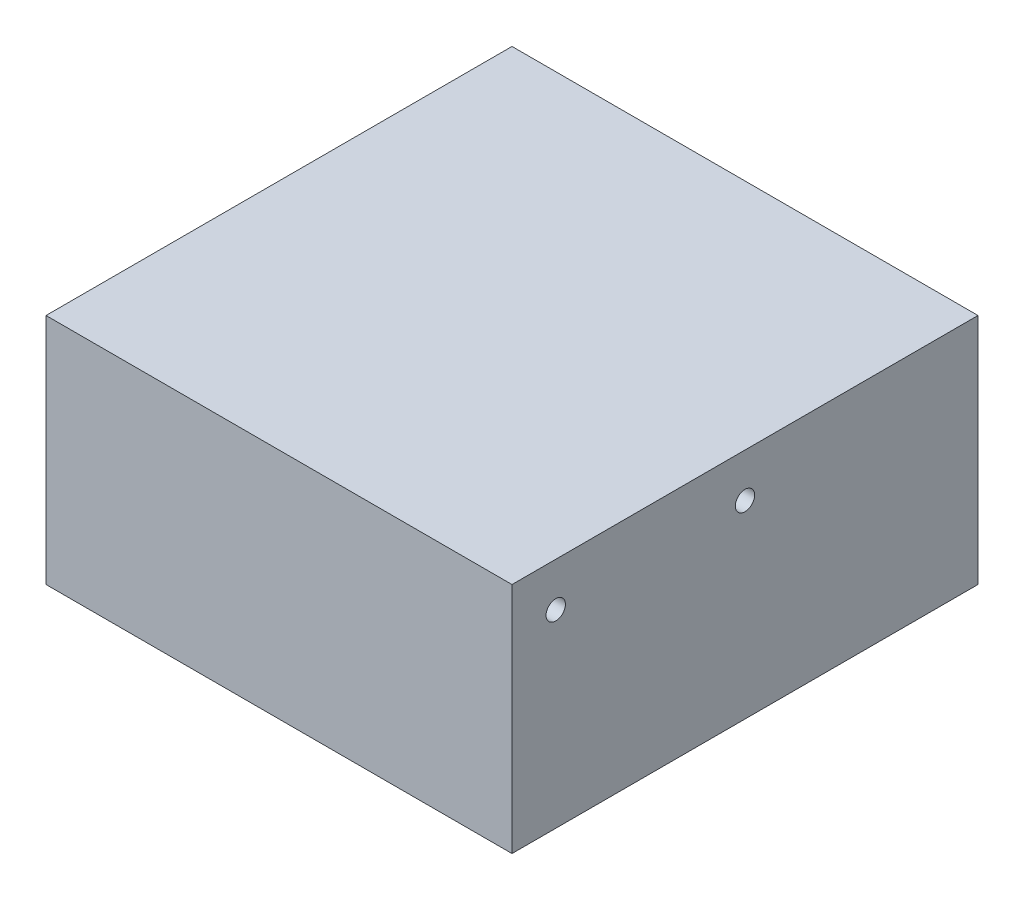
ISO-10303-21;
HEADER;
FILE_DESCRIPTION(('STEP AP214'),'2;1');
FILE_NAME('part.step','',(''),(''),'','','');
FILE_SCHEMA(('AUTOMOTIVE_DESIGN { 1 0 10303 214 1 1 1 1 }'));
ENDSEC;
DATA;
#1=APPLICATION_CONTEXT('core data for automotive mechanical design processes');
#2=APPLICATION_PROTOCOL_DEFINITION('international standard','automotive_design',2000,#1);
#3=PRODUCT_CONTEXT('',#1,'mechanical');
#4=PRODUCT('Part','Part','',(#3));
#5=PRODUCT_RELATED_PRODUCT_CATEGORY('part','',(#4));
#6=PRODUCT_DEFINITION_FORMATION('','',#4);
#7=PRODUCT_DEFINITION_CONTEXT('part definition',#1,'design');
#8=PRODUCT_DEFINITION('design','',#6,#7);
#9=PRODUCT_DEFINITION_SHAPE('','',#8);
#10=(LENGTH_UNIT() NAMED_UNIT(*) SI_UNIT(.MILLI.,.METRE.));
#11=(NAMED_UNIT(*) PLANE_ANGLE_UNIT() SI_UNIT($,.RADIAN.));
#12=(NAMED_UNIT(*) SI_UNIT($,.STERADIAN.) SOLID_ANGLE_UNIT());
#13=UNCERTAINTY_MEASURE_WITH_UNIT(LENGTH_MEASURE(1.E-05),#10,'distance_accuracy_value','');
#14=(GEOMETRIC_REPRESENTATION_CONTEXT(3) GLOBAL_UNCERTAINTY_ASSIGNED_CONTEXT((#13)) GLOBAL_UNIT_ASSIGNED_CONTEXT((#10,
#11,#12)) REPRESENTATION_CONTEXT('',''));
#15=CARTESIAN_POINT('',(0.,0.,0.));
#16=DIRECTION('',(0.,0.,1.));
#17=DIRECTION('',(1.,0.,0.));
#18=AXIS2_PLACEMENT_3D('',#15,#16,#17);
#19=CARTESIAN_POINT('',(0.,0.,0.));
#20=DIRECTION('',(0.,-1.,0.));
#21=DIRECTION('',(0.,0.,-1.));
#22=AXIS2_PLACEMENT_3D('',#19,#20,#21);
#23=PLANE('',#22);
#24=DIRECTION('',(0.,0.,-1.));
#25=VECTOR('',#24,1.);
#26=CARTESIAN_POINT('',(86.,0.,86.));
#27=LINE('',#26,#25);
#28=CARTESIAN_POINT('',(86.,0.,86.));
#29=VERTEX_POINT('',#28);
#30=CARTESIAN_POINT('',(86.,0.,-86.));
#31=VERTEX_POINT('',#30);
#32=EDGE_CURVE('E96',#29,#31,#27,.T.);
#33=ORIENTED_EDGE('',*,*,#32,.F.);
#34=DIRECTION('',(1.,0.,0.));
#35=VECTOR('',#34,1.);
#36=CARTESIAN_POINT('',(-86.,0.,86.));
#37=LINE('',#36,#35);
#38=CARTESIAN_POINT('',(-86.,0.,86.));
#39=VERTEX_POINT('',#38);
#40=EDGE_CURVE('E72',#39,#29,#37,.T.);
#41=ORIENTED_EDGE('',*,*,#40,.F.);
#42=DIRECTION('',(0.,0.,1.));
#43=VECTOR('',#42,1.);
#44=CARTESIAN_POINT('',(-86.,0.,86.));
#45=LINE('',#44,#43);
#46=CARTESIAN_POINT('',(-86.,0.,-86.));
#47=VERTEX_POINT('',#46);
#48=EDGE_CURVE('E66',#47,#39,#45,.T.);
#49=ORIENTED_EDGE('',*,*,#48,.F.);
#50=DIRECTION('',(-1.,0.,0.));
#51=VECTOR('',#50,1.);
#52=CARTESIAN_POINT('',(-86.,0.,-86.));
#53=LINE('',#52,#51);
#54=EDGE_CURVE('E88',#31,#47,#53,.T.);
#55=ORIENTED_EDGE('',*,*,#54,.F.);
#56=EDGE_LOOP('',(#33,#41,#49,#55));
#57=FACE_BOUND('',#56,.T.);
#58=CARTESIAN_POINT('',(0.,0.,0.));
#59=DIRECTION('',(0.,1.,0.));
#60=DIRECTION('',(0.,0.,1.));
#61=AXIS2_PLACEMENT_3D('',#58,#59,#60);
#62=CIRCLE('',#61,35.);
#63=CARTESIAN_POINT('',(0.,0.,35.));
#64=VERTEX_POINT('',#63);
#65=EDGE_CURVE('E99',#64,#64,#62,.T.);
#66=ORIENTED_EDGE('',*,*,#65,.T.);
#67=EDGE_LOOP('',(#66));
#68=FACE_BOUND('',#67,.T.);
#69=ADVANCED_FACE('F32',(#57,#68),#23,.T.);
#70=CARTESIAN_POINT('',(86.,86.,86.));
#71=DIRECTION('',(-1.,0.,0.));
#72=DIRECTION('',(0.,0.,1.));
#73=AXIS2_PLACEMENT_3D('',#70,#71,#72);
#74=PLANE('',#73);
#75=CARTESIAN_POINT('',(86.,69.85,0.));
#76=DIRECTION('',(1.,0.,0.));
#77=DIRECTION('',(0.,0.,-1.));
#78=AXIS2_PLACEMENT_3D('',#75,#76,#77);
#79=CIRCLE('',#78,3.56870000000001);
#80=CARTESIAN_POINT('',(86.,69.85,-3.56870000000001));
#81=VERTEX_POINT('',#80);
#82=EDGE_CURVE('E121',#81,#81,#79,.T.);
#83=ORIENTED_EDGE('',*,*,#82,.F.);
#84=EDGE_LOOP('',(#83));
#85=FACE_BOUND('',#84,.T.);
#86=CARTESIAN_POINT('',(86.,69.85,69.85));
#87=DIRECTION('',(1.,0.,0.));
#88=DIRECTION('',(0.,0.,-1.));
#89=AXIS2_PLACEMENT_3D('',#86,#87,#88);
#90=CIRCLE('',#89,3.56870000000001);
#91=CARTESIAN_POINT('',(86.,69.85,66.2813));
#92=VERTEX_POINT('',#91);
#93=EDGE_CURVE('E115',#92,#92,#90,.T.);
#94=ORIENTED_EDGE('',*,*,#93,.F.);
#95=EDGE_LOOP('',(#94));
#96=FACE_BOUND('',#95,.T.);
#97=ORIENTED_EDGE('',*,*,#32,.T.);
#98=DIRECTION('',(0.,-1.,0.));
#99=VECTOR('',#98,1.);
#100=CARTESIAN_POINT('',(86.,86.,-86.));
#101=LINE('',#100,#99);
#102=CARTESIAN_POINT('',(86.,86.,-86.));
#103=VERTEX_POINT('',#102);
#104=EDGE_CURVE('E11',#103,#31,#101,.T.);
#105=ORIENTED_EDGE('',*,*,#104,.F.);
#106=DIRECTION('',(0.,0.,-1.));
#107=VECTOR('',#106,1.);
#108=CARTESIAN_POINT('',(86.,86.,86.));
#109=LINE('',#108,#107);
#110=CARTESIAN_POINT('',(86.,86.,86.));
#111=VERTEX_POINT('',#110);
#112=EDGE_CURVE('E84',#111,#103,#109,.T.);
#113=ORIENTED_EDGE('',*,*,#112,.F.);
#114=DIRECTION('',(0.,-1.,0.));
#115=VECTOR('',#114,1.);
#116=CARTESIAN_POINT('',(86.,86.,86.));
#117=LINE('',#116,#115);
#118=EDGE_CURVE('E92',#111,#29,#117,.T.);
#119=ORIENTED_EDGE('',*,*,#118,.T.);
#120=EDGE_LOOP('',(#97,#105,#113,#119));
#121=FACE_BOUND('',#120,.T.);
#122=ADVANCED_FACE('F34',(#85,#96,#121),#74,.F.);
#123=CARTESIAN_POINT('',(-86.,86.,-86.));
#124=DIRECTION('',(0.,0.,1.));
#125=DIRECTION('',(1.,0.,0.));
#126=AXIS2_PLACEMENT_3D('',#123,#124,#125);
#127=PLANE('',#126);
#128=ORIENTED_EDGE('',*,*,#54,.T.);
#129=DIRECTION('',(0.,-1.,0.));
#130=VECTOR('',#129,1.);
#131=CARTESIAN_POINT('',(-86.,86.,-86.));
#132=LINE('',#131,#130);
#133=CARTESIAN_POINT('',(-86.,86.,-86.));
#134=VERTEX_POINT('',#133);
#135=EDGE_CURVE('E41',#134,#47,#132,.T.);
#136=ORIENTED_EDGE('',*,*,#135,.F.);
#137=DIRECTION('',(-1.,0.,0.));
#138=VECTOR('',#137,1.);
#139=CARTESIAN_POINT('',(-86.,86.,-86.));
#140=LINE('',#139,#138);
#141=EDGE_CURVE('E79',#103,#134,#140,.T.);
#142=ORIENTED_EDGE('',*,*,#141,.F.);
#143=ORIENTED_EDGE('',*,*,#104,.T.);
#144=EDGE_LOOP('',(#128,#136,#142,#143));
#145=FACE_BOUND('',#144,.T.);
#146=ADVANCED_FACE('F87',(#145),#127,.F.);
#147=CARTESIAN_POINT('',(-86.,86.,86.));
#148=DIRECTION('',(1.,0.,0.));
#149=DIRECTION('',(0.,0.,-1.));
#150=AXIS2_PLACEMENT_3D('',#147,#148,#149);
#151=PLANE('',#150);
#152=CARTESIAN_POINT('',(-86.,69.85,0.));
#153=DIRECTION('',(1.,0.,0.));
#154=DIRECTION('',(0.,0.,-1.));
#155=AXIS2_PLACEMENT_3D('',#152,#153,#154);
#156=CIRCLE('',#155,3.56870000000001);
#157=CARTESIAN_POINT('',(-86.,69.85,-3.56870000000001));
#158=VERTEX_POINT('',#157);
#159=EDGE_CURVE('E118',#158,#158,#156,.T.);
#160=ORIENTED_EDGE('',*,*,#159,.T.);
#161=EDGE_LOOP('',(#160));
#162=FACE_BOUND('',#161,.T.);
#163=CARTESIAN_POINT('',(-86.,69.85,69.85));
#164=DIRECTION('',(1.,0.,0.));
#165=DIRECTION('',(0.,0.,-1.));
#166=AXIS2_PLACEMENT_3D('',#163,#164,#165);
#167=CIRCLE('',#166,3.56870000000001);
#168=CARTESIAN_POINT('',(-86.,69.85,66.2813));
#169=VERTEX_POINT('',#168);
#170=EDGE_CURVE('E112',#169,#169,#167,.T.);
#171=ORIENTED_EDGE('',*,*,#170,.T.);
#172=EDGE_LOOP('',(#171));
#173=FACE_BOUND('',#172,.T.);
#174=ORIENTED_EDGE('',*,*,#48,.T.);
#175=DIRECTION('',(0.,-1.,0.));
#176=VECTOR('',#175,1.);
#177=CARTESIAN_POINT('',(-86.,86.,86.));
#178=LINE('',#177,#176);
#179=CARTESIAN_POINT('',(-86.,86.,86.));
#180=VERTEX_POINT('',#179);
#181=EDGE_CURVE('E89',#180,#39,#178,.T.);
#182=ORIENTED_EDGE('',*,*,#181,.F.);
#183=DIRECTION('',(0.,0.,1.));
#184=VECTOR('',#183,1.);
#185=CARTESIAN_POINT('',(-86.,86.,86.));
#186=LINE('',#185,#184);
#187=EDGE_CURVE('E82',#134,#180,#186,.T.);
#188=ORIENTED_EDGE('',*,*,#187,.F.);
#189=ORIENTED_EDGE('',*,*,#135,.T.);
#190=EDGE_LOOP('',(#174,#182,#188,#189));
#191=FACE_BOUND('',#190,.T.);
#192=ADVANCED_FACE('F90',(#162,#173,#191),#151,.F.);
#193=CARTESIAN_POINT('',(-86.,86.,86.));
#194=DIRECTION('',(0.,0.,-1.));
#195=DIRECTION('',(-1.,0.,0.));
#196=AXIS2_PLACEMENT_3D('',#193,#194,#195);
#197=PLANE('',#196);
#198=ORIENTED_EDGE('',*,*,#40,.T.);
#199=ORIENTED_EDGE('',*,*,#118,.F.);
#200=DIRECTION('',(1.,0.,0.));
#201=VECTOR('',#200,1.);
#202=CARTESIAN_POINT('',(-86.,86.,86.));
#203=LINE('',#202,#201);
#204=EDGE_CURVE('E49',#180,#111,#203,.T.);
#205=ORIENTED_EDGE('',*,*,#204,.F.);
#206=ORIENTED_EDGE('',*,*,#181,.T.);
#207=EDGE_LOOP('',(#198,#199,#205,#206));
#208=FACE_BOUND('',#207,.T.);
#209=ADVANCED_FACE('F104',(#208),#197,.F.);
#210=CARTESIAN_POINT('',(0.,86.,0.));
#211=DIRECTION('',(0.,-1.,0.));
#212=DIRECTION('',(0.,0.,-1.));
#213=AXIS2_PLACEMENT_3D('',#210,#211,#212);
#214=PLANE('',#213);
#215=ORIENTED_EDGE('',*,*,#112,.T.);
#216=ORIENTED_EDGE('',*,*,#141,.T.);
#217=ORIENTED_EDGE('',*,*,#187,.T.);
#218=ORIENTED_EDGE('',*,*,#204,.T.);
#219=EDGE_LOOP('',(#215,#216,#217,#218));
#220=FACE_BOUND('',#219,.T.);
#221=ADVANCED_FACE('F80',(#220),#214,.F.);
#222=CARTESIAN_POINT('',(0.,0.,0.));
#223=DIRECTION('',(0.,1.,0.));
#224=DIRECTION('',(1.,0.,0.));
#225=AXIS2_PLACEMENT_3D('',#222,#223,#224);
#226=SPHERICAL_SURFACE('',#225,35.);
#227=ORIENTED_EDGE('',*,*,#65,.F.);
#228=EDGE_LOOP('',(#227));
#229=FACE_BOUND('',#228,.T.);
#230=ADVANCED_FACE('F133',(#229),#226,.F.);
#231=CARTESIAN_POINT('',(-86.,69.85,69.85));
#232=DIRECTION('',(1.,0.,0.));
#233=DIRECTION('',(0.,0.,-1.));
#234=AXIS2_PLACEMENT_3D('',#231,#232,#233);
#235=CYLINDRICAL_SURFACE('',#234,3.56870000000001);
#236=ORIENTED_EDGE('',*,*,#170,.F.);
#237=EDGE_LOOP('',(#236));
#238=FACE_BOUND('',#237,.T.);
#239=ORIENTED_EDGE('',*,*,#93,.T.);
#240=EDGE_LOOP('',(#239));
#241=FACE_BOUND('',#240,.T.);
#242=ADVANCED_FACE('F131',(#238,#241),#235,.F.);
#243=CARTESIAN_POINT('',(-86.,69.85,0.));
#244=DIRECTION('',(1.,0.,0.));
#245=DIRECTION('',(0.,0.,-1.));
#246=AXIS2_PLACEMENT_3D('',#243,#244,#245);
#247=CYLINDRICAL_SURFACE('',#246,3.56870000000001);
#248=ORIENTED_EDGE('',*,*,#159,.F.);
#249=EDGE_LOOP('',(#248));
#250=FACE_BOUND('',#249,.T.);
#251=ORIENTED_EDGE('',*,*,#82,.T.);
#252=EDGE_LOOP('',(#251));
#253=FACE_BOUND('',#252,.T.);
#254=ADVANCED_FACE('F125',(#250,#253),#247,.F.);
#255=CLOSED_SHELL('',(#69,#122,#146,#192,#209,#221,#230,#242,#254));
#256=MANIFOLD_SOLID_BREP('B2',#255);
#257=ADVANCED_BREP_SHAPE_REPRESENTATION('',(#18,#256),#14);
#258=SHAPE_DEFINITION_REPRESENTATION(#9,#257);
ENDSEC;
END-ISO-10303-21;
